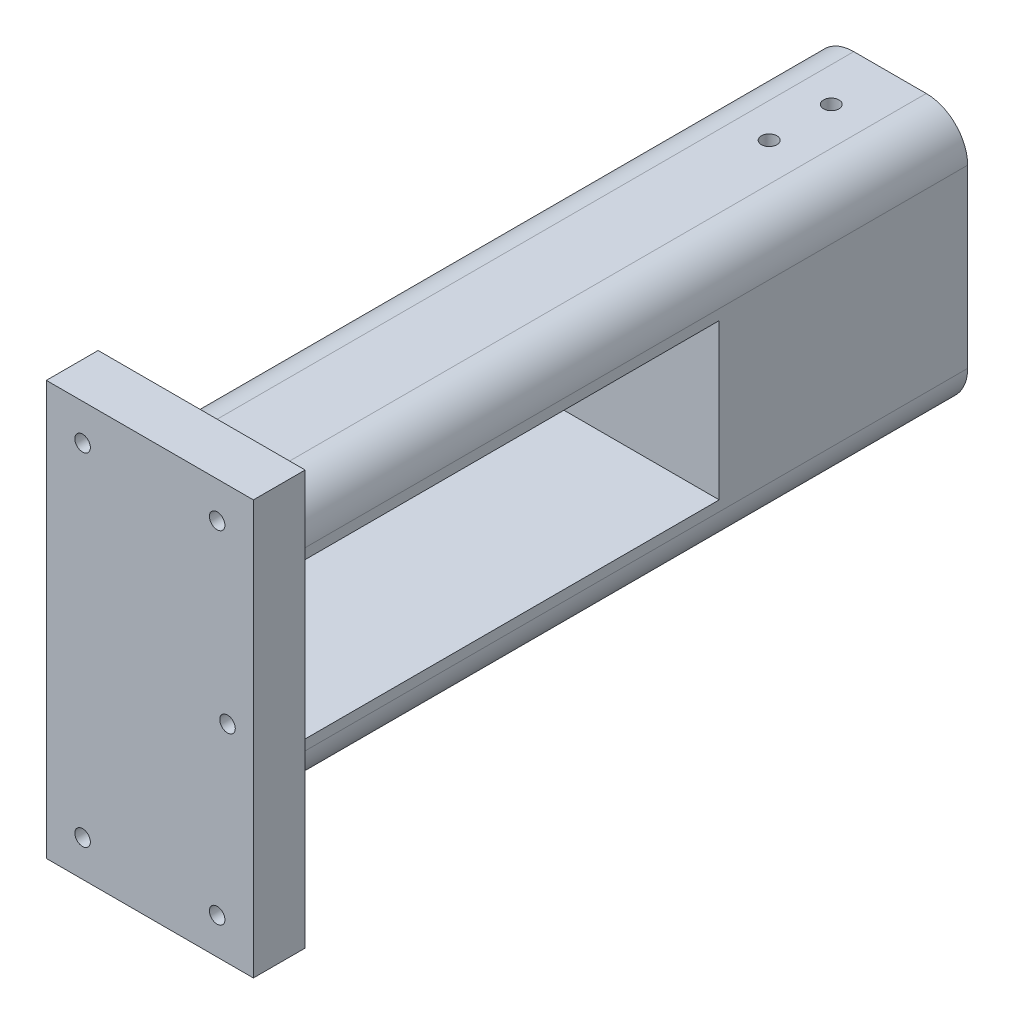
ISO-10303-21;
HEADER;
FILE_DESCRIPTION(('STEP AP214'),'2;1');
FILE_NAME('part.step','',(''),(''),'','','');
FILE_SCHEMA(('AUTOMOTIVE_DESIGN { 1 0 10303 214 1 1 1 1 }'));
ENDSEC;
DATA;
#1=APPLICATION_CONTEXT('core data for automotive mechanical design processes');
#2=APPLICATION_PROTOCOL_DEFINITION('international standard','automotive_design',2000,#1);
#3=PRODUCT_CONTEXT('',#1,'mechanical');
#4=PRODUCT('Part','Part','',(#3));
#5=PRODUCT_RELATED_PRODUCT_CATEGORY('part','',(#4));
#6=PRODUCT_DEFINITION_FORMATION('','',#4);
#7=PRODUCT_DEFINITION_CONTEXT('part definition',#1,'design');
#8=PRODUCT_DEFINITION('design','',#6,#7);
#9=PRODUCT_DEFINITION_SHAPE('','',#8);
#10=(LENGTH_UNIT() NAMED_UNIT(*) SI_UNIT(.MILLI.,.METRE.));
#11=(NAMED_UNIT(*) PLANE_ANGLE_UNIT() SI_UNIT($,.RADIAN.));
#12=(NAMED_UNIT(*) SI_UNIT($,.STERADIAN.) SOLID_ANGLE_UNIT());
#13=UNCERTAINTY_MEASURE_WITH_UNIT(LENGTH_MEASURE(1.E-05),#10,'distance_accuracy_value','');
#14=(GEOMETRIC_REPRESENTATION_CONTEXT(3) GLOBAL_UNCERTAINTY_ASSIGNED_CONTEXT((#13)) GLOBAL_UNIT_ASSIGNED_CONTEXT((#10,
#11,#12)) REPRESENTATION_CONTEXT('',''));
#15=CARTESIAN_POINT('',(0.,0.,0.));
#16=DIRECTION('',(0.,0.,1.));
#17=DIRECTION('',(1.,0.,0.));
#18=AXIS2_PLACEMENT_3D('',#15,#16,#17);
#19=CARTESIAN_POINT('',(-19.9988196070783,22.4242037473265,10.));
#20=DIRECTION('',(0.,0.,-1.));
#21=DIRECTION('',(-1.,0.,0.));
#22=AXIS2_PLACEMENT_3D('',#19,#20,#21);
#23=CYLINDRICAL_SURFACE('',#22,8.);
#24=DIRECTION('',(0.,0.,-1.));
#25=VECTOR('',#24,1.);
#26=CARTESIAN_POINT('',(-27.9988196070783,22.4242037473265,10.));
#27=LINE('',#26,#25);
#28=CARTESIAN_POINT('',(-27.9988196070783,22.4242037473265,0.));
#29=VERTEX_POINT('',#28);
#30=CARTESIAN_POINT('',(-27.9988196070783,22.4242037473265,-138.));
#31=VERTEX_POINT('',#30);
#32=EDGE_CURVE('E285',#29,#31,#27,.T.);
#33=ORIENTED_EDGE('',*,*,#32,.F.);
#34=CARTESIAN_POINT('',(-19.9988196070783,22.4242037473265,0.));
#35=DIRECTION('',(0.,0.,-1.));
#36=DIRECTION('',(-1.,0.,0.));
#37=AXIS2_PLACEMENT_3D('',#34,#35,#36);
#38=CIRCLE('',#37,8.);
#39=CARTESIAN_POINT('',(-19.9988196070783,30.4242037473265,0.));
#40=VERTEX_POINT('',#39);
#41=EDGE_CURVE('E11',#29,#40,#38,.T.);
#42=ORIENTED_EDGE('',*,*,#41,.T.);
#43=DIRECTION('',(0.,0.,-1.));
#44=VECTOR('',#43,1.);
#45=CARTESIAN_POINT('',(-19.9988196070783,30.4242037473265,-100.));
#46=LINE('',#45,#44);
#47=CARTESIAN_POINT('',(-19.9988196070783,30.4242037473265,-138.));
#48=VERTEX_POINT('',#47);
#49=EDGE_CURVE('E288',#48,#40,#46,.F.);
#50=ORIENTED_EDGE('',*,*,#49,.F.);
#51=CARTESIAN_POINT('',(-19.9988196070783,22.4242037473265,-138.));
#52=DIRECTION('',(0.,0.,1.));
#53=DIRECTION('',(1.,0.,0.));
#54=AXIS2_PLACEMENT_3D('',#51,#52,#53);
#55=CIRCLE('',#54,8.);
#56=EDGE_CURVE('E42',#31,#48,#55,.F.);
#57=ORIENTED_EDGE('',*,*,#56,.F.);
#58=EDGE_LOOP('',(#33,#42,#50,#57));
#59=FACE_BOUND('',#58,.T.);
#60=ADVANCED_FACE('F34',(#59),#23,.T.);
#61=CARTESIAN_POINT('',(-19.9988196070783,-11.5757962526735,10.));
#62=DIRECTION('',(0.,0.,1.));
#63=DIRECTION('',(1.,0.,0.));
#64=AXIS2_PLACEMENT_3D('',#61,#62,#63);
#65=CYLINDRICAL_SURFACE('',#64,8.);
#66=DIRECTION('',(0.,0.,1.));
#67=VECTOR('',#66,1.);
#68=CARTESIAN_POINT('',(-27.9988196070783,-11.5757962526735,10.));
#69=LINE('',#68,#67);
#70=CARTESIAN_POINT('',(-27.9988196070783,-11.5757962526735,-138.));
#71=VERTEX_POINT('',#70);
#72=CARTESIAN_POINT('',(-27.9988196070783,-11.5757962526735,0.));
#73=VERTEX_POINT('',#72);
#74=EDGE_CURVE('E274',#71,#73,#69,.T.);
#75=ORIENTED_EDGE('',*,*,#74,.F.);
#76=CARTESIAN_POINT('',(-19.9988196070783,-11.5757962526735,-138.));
#77=DIRECTION('',(0.,0.,1.));
#78=DIRECTION('',(1.,0.,0.));
#79=AXIS2_PLACEMENT_3D('',#76,#77,#78);
#80=CIRCLE('',#79,8.);
#81=CARTESIAN_POINT('',(-19.9988196070783,-19.5757962526735,-138.));
#82=VERTEX_POINT('',#81);
#83=EDGE_CURVE('E280',#82,#71,#80,.F.);
#84=ORIENTED_EDGE('',*,*,#83,.F.);
#85=DIRECTION('',(0.,0.,1.));
#86=VECTOR('',#85,1.);
#87=CARTESIAN_POINT('',(-19.9988196070783,-19.5757962526735,-100.));
#88=LINE('',#87,#86);
#89=CARTESIAN_POINT('',(-19.9988196070783,-19.5757962526735,0.));
#90=VERTEX_POINT('',#89);
#91=EDGE_CURVE('E277',#90,#82,#88,.F.);
#92=ORIENTED_EDGE('',*,*,#91,.F.);
#93=CARTESIAN_POINT('',(-19.9988196070783,-11.5757962526735,0.));
#94=DIRECTION('',(0.,0.,-1.));
#95=DIRECTION('',(-1.,0.,0.));
#96=AXIS2_PLACEMENT_3D('',#93,#94,#95);
#97=CIRCLE('',#96,8.);
#98=EDGE_CURVE('E282',#90,#73,#97,.T.);
#99=ORIENTED_EDGE('',*,*,#98,.T.);
#100=EDGE_LOOP('',(#75,#84,#92,#99));
#101=FACE_BOUND('',#100,.T.);
#102=ADVANCED_FACE('F339',(#101),#65,.T.);
#103=CARTESIAN_POINT('',(-5.9988196070783,22.4242037473265,-100.));
#104=DIRECTION('',(0.,0.,-1.));
#105=DIRECTION('',(-1.,0.,0.));
#106=AXIS2_PLACEMENT_3D('',#103,#104,#105);
#107=CYLINDRICAL_SURFACE('',#106,8.);
#108=DIRECTION('',(0.,0.,-1.));
#109=VECTOR('',#108,1.);
#110=CARTESIAN_POINT('',(-5.9988196070783,30.4242037473265,-100.));
#111=LINE('',#110,#109);
#112=CARTESIAN_POINT('',(-5.9988196070783,30.4242037473265,0.));
#113=VERTEX_POINT('',#112);
#114=CARTESIAN_POINT('',(-5.9988196070783,30.4242037473265,-138.));
#115=VERTEX_POINT('',#114);
#116=EDGE_CURVE('E264',#113,#115,#111,.T.);
#117=ORIENTED_EDGE('',*,*,#116,.F.);
#118=CARTESIAN_POINT('',(-5.9988196070783,22.4242037473265,0.));
#119=DIRECTION('',(0.,0.,-1.));
#120=DIRECTION('',(-1.,0.,0.));
#121=AXIS2_PLACEMENT_3D('',#118,#119,#120);
#122=CIRCLE('',#121,8.);
#123=CARTESIAN_POINT('',(2.0011803929217,22.4242037473265,0.));
#124=VERTEX_POINT('',#123);
#125=EDGE_CURVE('E272',#113,#124,#122,.T.);
#126=ORIENTED_EDGE('',*,*,#125,.T.);
#127=DIRECTION('',(0.,0.,-1.));
#128=VECTOR('',#127,1.);
#129=CARTESIAN_POINT('',(2.0011803929217,22.4242037473265,-100.));
#130=LINE('',#129,#128);
#131=CARTESIAN_POINT('',(2.0011803929217,22.4242037473265,-138.));
#132=VERTEX_POINT('',#131);
#133=EDGE_CURVE('E267',#132,#124,#130,.F.);
#134=ORIENTED_EDGE('',*,*,#133,.F.);
#135=CARTESIAN_POINT('',(-5.9988196070783,22.4242037473265,-138.));
#136=DIRECTION('',(0.,0.,1.));
#137=DIRECTION('',(1.,0.,0.));
#138=AXIS2_PLACEMENT_3D('',#135,#136,#137);
#139=CIRCLE('',#138,8.);
#140=EDGE_CURVE('E270',#115,#132,#139,.F.);
#141=ORIENTED_EDGE('',*,*,#140,.F.);
#142=EDGE_LOOP('',(#117,#126,#134,#141));
#143=FACE_BOUND('',#142,.T.);
#144=ADVANCED_FACE('F328',(#143),#107,.T.);
#145=CARTESIAN_POINT('',(-5.9988196070783,-11.5757962526735,-100.));
#146=DIRECTION('',(0.,0.,-1.));
#147=DIRECTION('',(-1.,0.,0.));
#148=AXIS2_PLACEMENT_3D('',#145,#146,#147);
#149=CYLINDRICAL_SURFACE('',#148,8.);
#150=DIRECTION('',(0.,0.,-1.));
#151=VECTOR('',#150,1.);
#152=CARTESIAN_POINT('',(2.0011803929217,-11.5757962526735,-100.));
#153=LINE('',#152,#151);
#154=CARTESIAN_POINT('',(2.0011803929217,-11.5757962526735,0.));
#155=VERTEX_POINT('',#154);
#156=CARTESIAN_POINT('',(2.0011803929217,-11.5757962526735,-138.));
#157=VERTEX_POINT('',#156);
#158=EDGE_CURVE('E255',#155,#157,#153,.T.);
#159=ORIENTED_EDGE('',*,*,#158,.F.);
#160=CARTESIAN_POINT('',(-5.9988196070783,-11.5757962526735,0.));
#161=DIRECTION('',(0.,0.,-1.));
#162=DIRECTION('',(-1.,0.,0.));
#163=AXIS2_PLACEMENT_3D('',#160,#161,#162);
#164=CIRCLE('',#163,8.);
#165=CARTESIAN_POINT('',(-5.9988196070783,-19.5757962526735,0.));
#166=VERTEX_POINT('',#165);
#167=EDGE_CURVE('E262',#155,#166,#164,.T.);
#168=ORIENTED_EDGE('',*,*,#167,.T.);
#169=DIRECTION('',(0.,0.,-1.));
#170=VECTOR('',#169,1.);
#171=CARTESIAN_POINT('',(-5.9988196070783,-19.5757962526735,-100.));
#172=LINE('',#171,#170);
#173=CARTESIAN_POINT('',(-5.9988196070783,-19.5757962526735,-138.));
#174=VERTEX_POINT('',#173);
#175=EDGE_CURVE('E257',#174,#166,#172,.F.);
#176=ORIENTED_EDGE('',*,*,#175,.F.);
#177=CARTESIAN_POINT('',(-5.9988196070783,-11.5757962526735,-138.));
#178=DIRECTION('',(0.,0.,1.));
#179=DIRECTION('',(1.,0.,0.));
#180=AXIS2_PLACEMENT_3D('',#177,#178,#179);
#181=CIRCLE('',#180,8.);
#182=EDGE_CURVE('E260',#157,#174,#181,.F.);
#183=ORIENTED_EDGE('',*,*,#182,.F.);
#184=EDGE_LOOP('',(#159,#168,#176,#183));
#185=FACE_BOUND('',#184,.T.);
#186=ADVANCED_FACE('F320',(#185),#149,.T.);
#187=CARTESIAN_POINT('',(12.0011803929217,45.4242037473265,10.));
#188=DIRECTION('',(-1.,0.,0.));
#189=DIRECTION('',(0.,-1.,0.));
#190=AXIS2_PLACEMENT_3D('',#187,#188,#189);
#191=PLANE('',#190);
#192=DIRECTION('',(0.,1.,0.));
#193=VECTOR('',#192,1.);
#194=CARTESIAN_POINT('',(12.0011803929217,45.4242037473265,0.));
#195=LINE('',#194,#193);
#196=CARTESIAN_POINT('',(12.0011803929217,-34.5757962526735,0.));
#197=VERTEX_POINT('',#196);
#198=CARTESIAN_POINT('',(12.0011803929217,45.4242037473265,0.));
#199=VERTEX_POINT('',#198);
#200=EDGE_CURVE('E291',#197,#199,#195,.T.);
#201=ORIENTED_EDGE('',*,*,#200,.T.);
#202=DIRECTION('',(0.,0.,-1.));
#203=VECTOR('',#202,1.);
#204=CARTESIAN_POINT('',(12.0011803929217,45.4242037473265,10.));
#205=LINE('',#204,#203);
#206=CARTESIAN_POINT('',(12.0011803929217,45.4242037473265,10.));
#207=VERTEX_POINT('',#206);
#208=EDGE_CURVE('E303',#207,#199,#205,.T.);
#209=ORIENTED_EDGE('',*,*,#208,.F.);
#210=DIRECTION('',(0.,1.,0.));
#211=VECTOR('',#210,1.);
#212=CARTESIAN_POINT('',(12.0011803929217,45.4242037473265,10.));
#213=LINE('',#212,#211);
#214=CARTESIAN_POINT('',(12.0011803929217,-34.5757962526735,10.));
#215=VERTEX_POINT('',#214);
#216=EDGE_CURVE('E248',#215,#207,#213,.T.);
#217=ORIENTED_EDGE('',*,*,#216,.F.);
#218=DIRECTION('',(0.,0.,-1.));
#219=VECTOR('',#218,1.);
#220=CARTESIAN_POINT('',(12.0011803929217,-34.5757962526735,10.));
#221=LINE('',#220,#219);
#222=EDGE_CURVE('E622',#215,#197,#221,.T.);
#223=ORIENTED_EDGE('',*,*,#222,.T.);
#224=EDGE_LOOP('',(#201,#209,#217,#223));
#225=FACE_BOUND('',#224,.T.);
#226=ADVANCED_FACE('F397',(#225),#191,.F.);
#227=CARTESIAN_POINT('',(12.0011803929217,45.4242037473265,10.));
#228=DIRECTION('',(0.,-1.,0.));
#229=DIRECTION('',(1.,0.,0.));
#230=AXIS2_PLACEMENT_3D('',#227,#228,#229);
#231=PLANE('',#230);
#232=DIRECTION('',(-1.,0.,0.));
#233=VECTOR('',#232,1.);
#234=CARTESIAN_POINT('',(12.0011803929217,45.4242037473265,0.));
#235=LINE('',#234,#233);
#236=CARTESIAN_POINT('',(-27.9988196070783,45.4242037473265,0.));
#237=VERTEX_POINT('',#236);
#238=EDGE_CURVE('E618',#199,#237,#235,.T.);
#239=ORIENTED_EDGE('',*,*,#238,.T.);
#240=DIRECTION('',(0.,0.,-1.));
#241=VECTOR('',#240,1.);
#242=CARTESIAN_POINT('',(-27.9988196070783,45.4242037473265,10.));
#243=LINE('',#242,#241);
#244=CARTESIAN_POINT('',(-27.9988196070783,45.4242037473265,10.));
#245=VERTEX_POINT('',#244);
#246=EDGE_CURVE('E610',#245,#237,#243,.T.);
#247=ORIENTED_EDGE('',*,*,#246,.F.);
#248=DIRECTION('',(-1.,0.,0.));
#249=VECTOR('',#248,1.);
#250=CARTESIAN_POINT('',(12.0011803929217,45.4242037473265,10.));
#251=LINE('',#250,#249);
#252=EDGE_CURVE('E600',#207,#245,#251,.T.);
#253=ORIENTED_EDGE('',*,*,#252,.F.);
#254=ORIENTED_EDGE('',*,*,#208,.T.);
#255=EDGE_LOOP('',(#239,#247,#253,#254));
#256=FACE_BOUND('',#255,.T.);
#257=ADVANCED_FACE('F400',(#256),#231,.F.);
#258=CARTESIAN_POINT('',(-27.9988196070783,45.4242037473265,10.));
#259=DIRECTION('',(1.,0.,0.));
#260=DIRECTION('',(0.,1.,0.));
#261=AXIS2_PLACEMENT_3D('',#258,#259,#260);
#262=PLANE('',#261);
#263=DIRECTION('',(0.,0.,1.));
#264=VECTOR('',#263,1.);
#265=CARTESIAN_POINT('',(-27.9988196070783,-9.57579625267348,-90.));
#266=LINE('',#265,#264);
#267=CARTESIAN_POINT('',(-27.9988196070783,-9.57579625267348,-90.));
#268=VERTEX_POINT('',#267);
#269=CARTESIAN_POINT('',(-27.9988196070783,-9.57579625267348,-9.99999999999999));
#270=VERTEX_POINT('',#269);
#271=EDGE_CURVE('E225',#268,#270,#266,.T.);
#272=ORIENTED_EDGE('',*,*,#271,.F.);
#273=DIRECTION('',(0.,-1.,0.));
#274=VECTOR('',#273,1.);
#275=CARTESIAN_POINT('',(-27.9988196070783,-9.57579625267348,-90.));
#276=LINE('',#275,#274);
#277=CARTESIAN_POINT('',(-27.9988196070783,20.4242037473265,-90.));
#278=VERTEX_POINT('',#277);
#279=EDGE_CURVE('E223',#278,#268,#276,.T.);
#280=ORIENTED_EDGE('',*,*,#279,.F.);
#281=DIRECTION('',(0.,0.,-1.));
#282=VECTOR('',#281,1.);
#283=CARTESIAN_POINT('',(-27.9988196070783,20.4242037473265,-90.));
#284=LINE('',#283,#282);
#285=CARTESIAN_POINT('',(-27.9988196070783,20.4242037473265,-9.99999999999999));
#286=VERTEX_POINT('',#285);
#287=EDGE_CURVE('E231',#286,#278,#284,.T.);
#288=ORIENTED_EDGE('',*,*,#287,.F.);
#289=DIRECTION('',(0.,1.,0.));
#290=VECTOR('',#289,1.);
#291=CARTESIAN_POINT('',(-27.9988196070783,-9.57579625267348,-9.99999999999999));
#292=LINE('',#291,#290);
#293=EDGE_CURVE('E228',#270,#286,#292,.T.);
#294=ORIENTED_EDGE('',*,*,#293,.F.);
#295=EDGE_LOOP('',(#272,#280,#288,#294));
#296=FACE_BOUND('',#295,.T.);
#297=DIRECTION('',(0.,-1.,0.));
#298=VECTOR('',#297,1.);
#299=CARTESIAN_POINT('',(-27.9988196070783,45.4242037473265,0.));
#300=LINE('',#299,#298);
#301=EDGE_CURVE('E345',#237,#29,#300,.T.);
#302=ORIENTED_EDGE('',*,*,#301,.T.);
#303=ORIENTED_EDGE('',*,*,#32,.T.);
#304=DIRECTION('',(0.,1.,0.));
#305=VECTOR('',#304,1.);
#306=CARTESIAN_POINT('',(-27.9988196070783,-19.5757962526735,-138.));
#307=LINE('',#306,#305);
#308=EDGE_CURVE('E219',#71,#31,#307,.T.);
#309=ORIENTED_EDGE('',*,*,#308,.F.);
#310=ORIENTED_EDGE('',*,*,#74,.T.);
#311=CARTESIAN_POINT('',(-27.9988196070783,-34.5757962526735,0.));
#312=VERTEX_POINT('',#311);
#313=EDGE_CURVE('E296',#73,#312,#300,.T.);
#314=ORIENTED_EDGE('',*,*,#313,.T.);
#315=DIRECTION('',(0.,0.,-1.));
#316=VECTOR('',#315,1.);
#317=CARTESIAN_POINT('',(-27.9988196070783,-34.5757962526735,10.));
#318=LINE('',#317,#316);
#319=CARTESIAN_POINT('',(-27.9988196070783,-34.5757962526735,10.));
#320=VERTEX_POINT('',#319);
#321=EDGE_CURVE('E612',#320,#312,#318,.T.);
#322=ORIENTED_EDGE('',*,*,#321,.F.);
#323=DIRECTION('',(0.,-1.,0.));
#324=VECTOR('',#323,1.);
#325=CARTESIAN_POINT('',(-27.9988196070783,45.4242037473265,10.));
#326=LINE('',#325,#324);
#327=EDGE_CURVE('E629',#245,#320,#326,.T.);
#328=ORIENTED_EDGE('',*,*,#327,.F.);
#329=ORIENTED_EDGE('',*,*,#246,.T.);
#330=EDGE_LOOP('',(#302,#303,#309,#310,#314,#322,#328,#329));
#331=FACE_BOUND('',#330,.T.);
#332=ADVANCED_FACE('F342',(#296,#331),#262,.F.);
#333=CARTESIAN_POINT('',(12.0011803929217,-34.5757962526735,10.));
#334=DIRECTION('',(0.,1.,0.));
#335=DIRECTION('',(0.,0.,1.));
#336=AXIS2_PLACEMENT_3D('',#333,#334,#335);
#337=PLANE('',#336);
#338=DIRECTION('',(1.,0.,0.));
#339=VECTOR('',#338,1.);
#340=CARTESIAN_POINT('',(12.0011803929217,-34.5757962526735,0.));
#341=LINE('',#340,#339);
#342=EDGE_CURVE('E606',#312,#197,#341,.T.);
#343=ORIENTED_EDGE('',*,*,#342,.T.);
#344=ORIENTED_EDGE('',*,*,#222,.F.);
#345=DIRECTION('',(1.,0.,0.));
#346=VECTOR('',#345,1.);
#347=CARTESIAN_POINT('',(12.0011803929217,-34.5757962526735,10.));
#348=LINE('',#347,#346);
#349=EDGE_CURVE('E603',#320,#215,#348,.T.);
#350=ORIENTED_EDGE('',*,*,#349,.F.);
#351=ORIENTED_EDGE('',*,*,#321,.T.);
#352=EDGE_LOOP('',(#343,#344,#350,#351));
#353=FACE_BOUND('',#352,.T.);
#354=ADVANCED_FACE('F407',(#353),#337,.F.);
#355=CARTESIAN_POINT('',(0.,0.,10.));
#356=DIRECTION('',(0.,0.,-1.));
#357=DIRECTION('',(-1.,0.,0.));
#358=AXIS2_PLACEMENT_3D('',#355,#356,#357);
#359=PLANE('',#358);
#360=CARTESIAN_POINT('',(7.00118039292172,5.42420374732652,10.));
#361=DIRECTION('',(0.,0.,-1.));
#362=DIRECTION('',(-1.,0.,0.));
#363=AXIS2_PLACEMENT_3D('',#360,#361,#362);
#364=CIRCLE('',#363,1.5);
#365=CARTESIAN_POINT('',(5.50118039292172,5.42420374732652,10.));
#366=VERTEX_POINT('',#365);
#367=EDGE_CURVE('E492',#366,#366,#364,.T.);
#368=ORIENTED_EDGE('',*,*,#367,.T.);
#369=EDGE_LOOP('',(#368));
#370=FACE_BOUND('',#369,.T.);
#371=CARTESIAN_POINT('',(5.00118039292172,-27.5757962526735,10.));
#372=DIRECTION('',(0.,0.,-1.));
#373=DIRECTION('',(-1.,0.,0.));
#374=AXIS2_PLACEMENT_3D('',#371,#372,#373);
#375=CIRCLE('',#374,1.5);
#376=CARTESIAN_POINT('',(3.50118039292171,-27.5757962526735,10.));
#377=VERTEX_POINT('',#376);
#378=EDGE_CURVE('E486',#377,#377,#375,.T.);
#379=ORIENTED_EDGE('',*,*,#378,.T.);
#380=EDGE_LOOP('',(#379));
#381=FACE_BOUND('',#380,.T.);
#382=CARTESIAN_POINT('',(-20.9988196070783,-27.5757962526735,10.));
#383=DIRECTION('',(0.,0.,-1.));
#384=DIRECTION('',(-1.,0.,0.));
#385=AXIS2_PLACEMENT_3D('',#382,#383,#384);
#386=CIRCLE('',#385,1.5);
#387=CARTESIAN_POINT('',(-22.4988196070783,-27.5757962526735,10.));
#388=VERTEX_POINT('',#387);
#389=EDGE_CURVE('E480',#388,#388,#386,.T.);
#390=ORIENTED_EDGE('',*,*,#389,.T.);
#391=EDGE_LOOP('',(#390));
#392=FACE_BOUND('',#391,.T.);
#393=CARTESIAN_POINT('',(5.00118039292172,38.4242037473265,10.));
#394=DIRECTION('',(0.,0.,-1.));
#395=DIRECTION('',(-1.,0.,0.));
#396=AXIS2_PLACEMENT_3D('',#393,#394,#395);
#397=CIRCLE('',#396,1.5);
#398=CARTESIAN_POINT('',(3.50118039292171,38.4242037473265,10.));
#399=VERTEX_POINT('',#398);
#400=EDGE_CURVE('E472',#399,#399,#397,.T.);
#401=ORIENTED_EDGE('',*,*,#400,.T.);
#402=EDGE_LOOP('',(#401));
#403=FACE_BOUND('',#402,.T.);
#404=CARTESIAN_POINT('',(-20.9988196070783,38.4242037473265,10.));
#405=DIRECTION('',(0.,0.,-1.));
#406=DIRECTION('',(-1.,0.,0.));
#407=AXIS2_PLACEMENT_3D('',#404,#405,#406);
#408=CIRCLE('',#407,1.5);
#409=CARTESIAN_POINT('',(-22.4988196070783,38.4242037473265,10.));
#410=VERTEX_POINT('',#409);
#411=EDGE_CURVE('E464',#410,#410,#408,.T.);
#412=ORIENTED_EDGE('',*,*,#411,.T.);
#413=EDGE_LOOP('',(#412));
#414=FACE_BOUND('',#413,.T.);
#415=ORIENTED_EDGE('',*,*,#216,.T.);
#416=ORIENTED_EDGE('',*,*,#252,.T.);
#417=ORIENTED_EDGE('',*,*,#327,.T.);
#418=ORIENTED_EDGE('',*,*,#349,.T.);
#419=EDGE_LOOP('',(#415,#416,#417,#418));
#420=FACE_BOUND('',#419,.T.);
#421=ADVANCED_FACE('F411',(#370,#381,#392,#403,#414,#420),#359,.F.);
#422=CARTESIAN_POINT('',(0.,0.,0.));
#423=DIRECTION('',(0.,0.,-1.));
#424=DIRECTION('',(-1.,0.,0.));
#425=AXIS2_PLACEMENT_3D('',#422,#423,#424);
#426=PLANE('',#425);
#427=CARTESIAN_POINT('',(7.00118039292172,5.42420374732652,0.));
#428=DIRECTION('',(0.,0.,-1.));
#429=DIRECTION('',(-1.,0.,0.));
#430=AXIS2_PLACEMENT_3D('',#427,#428,#429);
#431=CIRCLE('',#430,1.5);
#432=CARTESIAN_POINT('',(5.50118039292172,5.42420374732652,0.));
#433=VERTEX_POINT('',#432);
#434=EDGE_CURVE('E495',#433,#433,#431,.T.);
#435=ORIENTED_EDGE('',*,*,#434,.F.);
#436=EDGE_LOOP('',(#435));
#437=FACE_BOUND('',#436,.T.);
#438=CARTESIAN_POINT('',(5.00118039292172,-27.5757962526735,0.));
#439=DIRECTION('',(0.,0.,-1.));
#440=DIRECTION('',(-1.,0.,0.));
#441=AXIS2_PLACEMENT_3D('',#438,#439,#440);
#442=CIRCLE('',#441,1.5);
#443=CARTESIAN_POINT('',(3.50118039292171,-27.5757962526735,0.));
#444=VERTEX_POINT('',#443);
#445=EDGE_CURVE('E489',#444,#444,#442,.T.);
#446=ORIENTED_EDGE('',*,*,#445,.F.);
#447=EDGE_LOOP('',(#446));
#448=FACE_BOUND('',#447,.T.);
#449=CARTESIAN_POINT('',(-20.9988196070783,-27.5757962526735,0.));
#450=DIRECTION('',(0.,0.,-1.));
#451=DIRECTION('',(-1.,0.,0.));
#452=AXIS2_PLACEMENT_3D('',#449,#450,#451);
#453=CIRCLE('',#452,1.5);
#454=CARTESIAN_POINT('',(-22.4988196070783,-27.5757962526735,0.));
#455=VERTEX_POINT('',#454);
#456=EDGE_CURVE('E483',#455,#455,#453,.T.);
#457=ORIENTED_EDGE('',*,*,#456,.F.);
#458=EDGE_LOOP('',(#457));
#459=FACE_BOUND('',#458,.T.);
#460=CARTESIAN_POINT('',(5.00118039292172,38.4242037473265,0.));
#461=DIRECTION('',(0.,0.,-1.));
#462=DIRECTION('',(-1.,0.,0.));
#463=AXIS2_PLACEMENT_3D('',#460,#461,#462);
#464=CIRCLE('',#463,1.5);
#465=CARTESIAN_POINT('',(3.50118039292171,38.4242037473265,0.));
#466=VERTEX_POINT('',#465);
#467=EDGE_CURVE('E477',#466,#466,#464,.T.);
#468=ORIENTED_EDGE('',*,*,#467,.F.);
#469=EDGE_LOOP('',(#468));
#470=FACE_BOUND('',#469,.T.);
#471=CARTESIAN_POINT('',(-20.9988196070783,38.4242037473265,0.));
#472=DIRECTION('',(0.,0.,-1.));
#473=DIRECTION('',(-1.,0.,0.));
#474=AXIS2_PLACEMENT_3D('',#471,#472,#473);
#475=CIRCLE('',#474,1.5);
#476=CARTESIAN_POINT('',(-22.4988196070783,38.4242037473265,0.));
#477=VERTEX_POINT('',#476);
#478=EDGE_CURVE('E467',#477,#477,#475,.T.);
#479=ORIENTED_EDGE('',*,*,#478,.F.);
#480=EDGE_LOOP('',(#479));
#481=FACE_BOUND('',#480,.T.);
#482=DIRECTION('',(1.,0.,0.));
#483=VECTOR('',#482,1.);
#484=CARTESIAN_POINT('',(2.0011803929217,30.4242037473265,0.));
#485=LINE('',#484,#483);
#486=EDGE_CURVE('E254',#40,#113,#485,.T.);
#487=ORIENTED_EDGE('',*,*,#486,.F.);
#488=ORIENTED_EDGE('',*,*,#41,.F.);
#489=ORIENTED_EDGE('',*,*,#301,.F.);
#490=ORIENTED_EDGE('',*,*,#238,.F.);
#491=ORIENTED_EDGE('',*,*,#200,.F.);
#492=ORIENTED_EDGE('',*,*,#342,.F.);
#493=ORIENTED_EDGE('',*,*,#313,.F.);
#494=ORIENTED_EDGE('',*,*,#98,.F.);
#495=DIRECTION('',(-1.,0.,0.));
#496=VECTOR('',#495,1.);
#497=CARTESIAN_POINT('',(2.0011803929217,-19.5757962526735,0.));
#498=LINE('',#497,#496);
#499=EDGE_CURVE('E245',#166,#90,#498,.T.);
#500=ORIENTED_EDGE('',*,*,#499,.F.);
#501=ORIENTED_EDGE('',*,*,#167,.F.);
#502=DIRECTION('',(0.,-1.,0.));
#503=VECTOR('',#502,1.);
#504=CARTESIAN_POINT('',(2.0011803929217,-19.5757962526735,0.));
#505=LINE('',#504,#503);
#506=EDGE_CURVE('E237',#124,#155,#505,.T.);
#507=ORIENTED_EDGE('',*,*,#506,.F.);
#508=ORIENTED_EDGE('',*,*,#125,.F.);
#509=EDGE_LOOP('',(#487,#488,#489,#490,#491,#492,#493,#494,#500,#501,#507,#508));
#510=FACE_BOUND('',#509,.T.);
#511=ADVANCED_FACE('F332',(#437,#448,#459,#470,#481,#510),#426,.T.);
#512=CARTESIAN_POINT('',(2.0011803929217,-19.5757962526735,-100.));
#513=DIRECTION('',(-1.,0.,0.));
#514=DIRECTION('',(0.,0.,1.));
#515=AXIS2_PLACEMENT_3D('',#512,#513,#514);
#516=PLANE('',#515);
#517=DIRECTION('',(0.,0.,-1.));
#518=VECTOR('',#517,1.);
#519=CARTESIAN_POINT('',(2.0011803929217,20.4242037473265,-100.));
#520=LINE('',#519,#518);
#521=CARTESIAN_POINT('',(2.0011803929217,20.4242037473265,-9.99999999999999));
#522=VERTEX_POINT('',#521);
#523=CARTESIAN_POINT('',(2.0011803929217,20.4242037473265,-90.));
#524=VERTEX_POINT('',#523);
#525=EDGE_CURVE('E306',#522,#524,#520,.T.);
#526=ORIENTED_EDGE('',*,*,#525,.T.);
#527=DIRECTION('',(0.,-1.,0.));
#528=VECTOR('',#527,1.);
#529=CARTESIAN_POINT('',(2.0011803929217,-19.5757962526735,-90.));
#530=LINE('',#529,#528);
#531=CARTESIAN_POINT('',(2.0011803929217,-9.57579625267347,-90.));
#532=VERTEX_POINT('',#531);
#533=EDGE_CURVE('E308',#524,#532,#530,.T.);
#534=ORIENTED_EDGE('',*,*,#533,.T.);
#535=DIRECTION('',(0.,0.,1.));
#536=VECTOR('',#535,1.);
#537=CARTESIAN_POINT('',(2.0011803929217,-9.57579625267347,-100.));
#538=LINE('',#537,#536);
#539=CARTESIAN_POINT('',(2.0011803929217,-9.57579625267347,-9.99999999999999));
#540=VERTEX_POINT('',#539);
#541=EDGE_CURVE('E299',#532,#540,#538,.T.);
#542=ORIENTED_EDGE('',*,*,#541,.T.);
#543=DIRECTION('',(0.,1.,0.));
#544=VECTOR('',#543,1.);
#545=CARTESIAN_POINT('',(2.0011803929217,-19.5757962526735,-9.99999999999999));
#546=LINE('',#545,#544);
#547=EDGE_CURVE('E302',#540,#522,#546,.T.);
#548=ORIENTED_EDGE('',*,*,#547,.T.);
#549=EDGE_LOOP('',(#526,#534,#542,#548));
#550=FACE_BOUND('',#549,.T.);
#551=DIRECTION('',(0.,-1.,0.));
#552=VECTOR('',#551,1.);
#553=CARTESIAN_POINT('',(2.0011803929217,-19.5757962526735,-138.));
#554=LINE('',#553,#552);
#555=EDGE_CURVE('E189',#132,#157,#554,.T.);
#556=ORIENTED_EDGE('',*,*,#555,.F.);
#557=ORIENTED_EDGE('',*,*,#133,.T.);
#558=ORIENTED_EDGE('',*,*,#506,.T.);
#559=ORIENTED_EDGE('',*,*,#158,.T.);
#560=EDGE_LOOP('',(#556,#557,#558,#559));
#561=FACE_BOUND('',#560,.T.);
#562=ADVANCED_FACE('F315',(#550,#561),#516,.F.);
#563=CARTESIAN_POINT('',(2.0011803929217,-19.5757962526735,-100.));
#564=DIRECTION('',(0.,1.,0.));
#565=DIRECTION('',(0.,0.,1.));
#566=AXIS2_PLACEMENT_3D('',#563,#564,#565);
#567=PLANE('',#566);
#568=CARTESIAN_POINT('',(-13.3488196070783,-19.5757962526735,-127.));
#569=DIRECTION('',(0.,1.,0.));
#570=DIRECTION('',(0.,0.,1.));
#571=AXIS2_PLACEMENT_3D('',#568,#569,#570);
#572=CIRCLE('',#571,1.5);
#573=CARTESIAN_POINT('',(-13.3488196070783,-19.5757962526735,-125.5));
#574=VERTEX_POINT('',#573);
#575=EDGE_CURVE('E349',#574,#574,#572,.T.);
#576=ORIENTED_EDGE('',*,*,#575,.T.);
#577=EDGE_LOOP('',(#576));
#578=FACE_BOUND('',#577,.T.);
#579=CARTESIAN_POINT('',(-13.3488196070783,-19.5757962526735,-115.));
#580=DIRECTION('',(0.,1.,0.));
#581=DIRECTION('',(0.,0.,1.));
#582=AXIS2_PLACEMENT_3D('',#579,#580,#581);
#583=CIRCLE('',#582,1.5);
#584=CARTESIAN_POINT('',(-13.3488196070783,-19.5757962526735,-113.5));
#585=VERTEX_POINT('',#584);
#586=EDGE_CURVE('E204',#585,#585,#583,.T.);
#587=ORIENTED_EDGE('',*,*,#586,.T.);
#588=EDGE_LOOP('',(#587));
#589=FACE_BOUND('',#588,.T.);
#590=ORIENTED_EDGE('',*,*,#499,.T.);
#591=ORIENTED_EDGE('',*,*,#91,.T.);
#592=DIRECTION('',(-1.,0.,0.));
#593=VECTOR('',#592,1.);
#594=CARTESIAN_POINT('',(2.0011803929217,-19.5757962526735,-138.));
#595=LINE('',#594,#593);
#596=EDGE_CURVE('E216',#174,#82,#595,.T.);
#597=ORIENTED_EDGE('',*,*,#596,.F.);
#598=ORIENTED_EDGE('',*,*,#175,.T.);
#599=EDGE_LOOP('',(#590,#591,#597,#598));
#600=FACE_BOUND('',#599,.T.);
#601=ADVANCED_FACE('F336',(#578,#589,#600),#567,.F.);
#602=CARTESIAN_POINT('',(2.0011803929217,30.4242037473265,-100.));
#603=DIRECTION('',(0.,-1.,0.));
#604=DIRECTION('',(0.,0.,-1.));
#605=AXIS2_PLACEMENT_3D('',#602,#603,#604);
#606=PLANE('',#605);
#607=CARTESIAN_POINT('',(-13.3488196070783,30.4242037473265,-127.));
#608=DIRECTION('',(0.,-1.,0.));
#609=DIRECTION('',(0.,0.,-1.));
#610=AXIS2_PLACEMENT_3D('',#607,#608,#609);
#611=CIRCLE('',#610,1.5);
#612=CARTESIAN_POINT('',(-13.3488196070783,30.4242037473265,-128.5));
#613=VERTEX_POINT('',#612);
#614=EDGE_CURVE('E356',#613,#613,#611,.T.);
#615=ORIENTED_EDGE('',*,*,#614,.T.);
#616=EDGE_LOOP('',(#615));
#617=FACE_BOUND('',#616,.T.);
#618=CARTESIAN_POINT('',(-13.3488196070783,30.4242037473265,-115.));
#619=DIRECTION('',(0.,-1.,0.));
#620=DIRECTION('',(0.,0.,-1.));
#621=AXIS2_PLACEMENT_3D('',#618,#619,#620);
#622=CIRCLE('',#621,1.5);
#623=CARTESIAN_POINT('',(-13.3488196070783,30.4242037473265,-116.5));
#624=VERTEX_POINT('',#623);
#625=EDGE_CURVE('E353',#624,#624,#622,.T.);
#626=ORIENTED_EDGE('',*,*,#625,.T.);
#627=EDGE_LOOP('',(#626));
#628=FACE_BOUND('',#627,.T.);
#629=DIRECTION('',(1.,0.,0.));
#630=VECTOR('',#629,1.);
#631=CARTESIAN_POINT('',(2.0011803929217,30.4242037473265,-138.));
#632=LINE('',#631,#630);
#633=EDGE_CURVE('E221',#48,#115,#632,.T.);
#634=ORIENTED_EDGE('',*,*,#633,.F.);
#635=ORIENTED_EDGE('',*,*,#49,.T.);
#636=ORIENTED_EDGE('',*,*,#486,.T.);
#637=ORIENTED_EDGE('',*,*,#116,.T.);
#638=EDGE_LOOP('',(#634,#635,#636,#637));
#639=FACE_BOUND('',#638,.T.);
#640=ADVANCED_FACE('F423',(#617,#628,#639),#606,.F.);
#641=CARTESIAN_POINT('',(122.001180392922,-9.57579625267345,-90.));
#642=DIRECTION('',(0.,0.,-1.));
#643=DIRECTION('',(-1.,0.,0.));
#644=AXIS2_PLACEMENT_3D('',#641,#642,#643);
#645=PLANE('',#644);
#646=DIRECTION('',(-1.,0.,0.));
#647=VECTOR('',#646,1.);
#648=CARTESIAN_POINT('',(122.001180392922,20.4242037473266,-90.));
#649=LINE('',#648,#647);
#650=EDGE_CURVE('E235',#524,#278,#649,.T.);
#651=ORIENTED_EDGE('',*,*,#650,.T.);
#652=ORIENTED_EDGE('',*,*,#279,.T.);
#653=DIRECTION('',(-1.,0.,0.));
#654=VECTOR('',#653,1.);
#655=CARTESIAN_POINT('',(122.001180392922,-9.57579625267345,-90.));
#656=LINE('',#655,#654);
#657=EDGE_CURVE('E234',#532,#268,#656,.T.);
#658=ORIENTED_EDGE('',*,*,#657,.F.);
#659=ORIENTED_EDGE('',*,*,#533,.F.);
#660=EDGE_LOOP('',(#651,#652,#658,#659));
#661=FACE_BOUND('',#660,.T.);
#662=ADVANCED_FACE('F425',(#661),#645,.F.);
#663=CARTESIAN_POINT('',(122.001180392922,20.4242037473266,-90.));
#664=DIRECTION('',(0.,1.,0.));
#665=DIRECTION('',(-1.,0.,0.));
#666=AXIS2_PLACEMENT_3D('',#663,#664,#665);
#667=PLANE('',#666);
#668=DIRECTION('',(-1.,0.,0.));
#669=VECTOR('',#668,1.);
#670=CARTESIAN_POINT('',(122.001180392922,20.4242037473266,-9.99999999999999));
#671=LINE('',#670,#669);
#672=EDGE_CURVE('E238',#522,#286,#671,.T.);
#673=ORIENTED_EDGE('',*,*,#672,.T.);
#674=ORIENTED_EDGE('',*,*,#287,.T.);
#675=ORIENTED_EDGE('',*,*,#650,.F.);
#676=ORIENTED_EDGE('',*,*,#525,.F.);
#677=EDGE_LOOP('',(#673,#674,#675,#676));
#678=FACE_BOUND('',#677,.T.);
#679=ADVANCED_FACE('F430',(#678),#667,.F.);
#680=CARTESIAN_POINT('',(122.001180392922,-9.57579625267345,-9.99999999999999));
#681=DIRECTION('',(0.,0.,1.));
#682=DIRECTION('',(1.,0.,0.));
#683=AXIS2_PLACEMENT_3D('',#680,#681,#682);
#684=PLANE('',#683);
#685=DIRECTION('',(-1.,0.,0.));
#686=VECTOR('',#685,1.);
#687=CARTESIAN_POINT('',(122.001180392922,-9.57579625267345,-9.99999999999999));
#688=LINE('',#687,#686);
#689=EDGE_CURVE('E240',#540,#270,#688,.T.);
#690=ORIENTED_EDGE('',*,*,#689,.T.);
#691=ORIENTED_EDGE('',*,*,#293,.T.);
#692=ORIENTED_EDGE('',*,*,#672,.F.);
#693=ORIENTED_EDGE('',*,*,#547,.F.);
#694=EDGE_LOOP('',(#690,#691,#692,#693));
#695=FACE_BOUND('',#694,.T.);
#696=ADVANCED_FACE('F435',(#695),#684,.F.);
#697=CARTESIAN_POINT('',(122.001180392922,-9.57579625267345,-90.));
#698=DIRECTION('',(0.,-1.,0.));
#699=DIRECTION('',(1.,0.,0.));
#700=AXIS2_PLACEMENT_3D('',#697,#698,#699);
#701=PLANE('',#700);
#702=ORIENTED_EDGE('',*,*,#657,.T.);
#703=ORIENTED_EDGE('',*,*,#271,.T.);
#704=ORIENTED_EDGE('',*,*,#689,.F.);
#705=ORIENTED_EDGE('',*,*,#541,.F.);
#706=EDGE_LOOP('',(#702,#703,#704,#705));
#707=FACE_BOUND('',#706,.T.);
#708=ADVANCED_FACE('F432',(#707),#701,.F.);
#709=CARTESIAN_POINT('',(0.,0.,-138.));
#710=DIRECTION('',(0.,0.,1.));
#711=DIRECTION('',(1.,0.,0.));
#712=AXIS2_PLACEMENT_3D('',#709,#710,#711);
#713=PLANE('',#712);
#714=ORIENTED_EDGE('',*,*,#308,.T.);
#715=ORIENTED_EDGE('',*,*,#56,.T.);
#716=ORIENTED_EDGE('',*,*,#633,.T.);
#717=ORIENTED_EDGE('',*,*,#140,.T.);
#718=ORIENTED_EDGE('',*,*,#555,.T.);
#719=ORIENTED_EDGE('',*,*,#182,.T.);
#720=ORIENTED_EDGE('',*,*,#596,.T.);
#721=ORIENTED_EDGE('',*,*,#83,.T.);
#722=EDGE_LOOP('',(#714,#715,#716,#717,#718,#719,#720,#721));
#723=FACE_BOUND('',#722,.T.);
#724=DIRECTION('',(0.,1.,0.));
#725=VECTOR('',#724,1.);
#726=CARTESIAN_POINT('',(-20.9988196070783,20.4242037473265,-138.));
#727=LINE('',#726,#725);
#728=CARTESIAN_POINT('',(-20.9988196070783,-10.0757962526735,-138.));
#729=VERTEX_POINT('',#728);
#730=CARTESIAN_POINT('',(-20.9988196070783,20.4242037473265,-138.));
#731=VERTEX_POINT('',#730);
#732=EDGE_CURVE('E171',#729,#731,#727,.T.);
#733=ORIENTED_EDGE('',*,*,#732,.F.);
#734=DIRECTION('',(-1.,0.,0.));
#735=VECTOR('',#734,1.);
#736=CARTESIAN_POINT('',(-20.9988196070783,-10.0757962526735,-138.));
#737=LINE('',#736,#735);
#738=CARTESIAN_POINT('',(-5.6988196070783,-10.0757962526735,-138.));
#739=VERTEX_POINT('',#738);
#740=EDGE_CURVE('E197',#739,#729,#737,.T.);
#741=ORIENTED_EDGE('',*,*,#740,.F.);
#742=DIRECTION('',(0.,-1.,0.));
#743=VECTOR('',#742,1.);
#744=CARTESIAN_POINT('',(-5.6988196070783,20.4242037473265,-138.));
#745=LINE('',#744,#743);
#746=CARTESIAN_POINT('',(-5.6988196070783,20.4242037473265,-138.));
#747=VERTEX_POINT('',#746);
#748=EDGE_CURVE('E195',#747,#739,#745,.T.);
#749=ORIENTED_EDGE('',*,*,#748,.F.);
#750=DIRECTION('',(1.,0.,0.));
#751=VECTOR('',#750,1.);
#752=CARTESIAN_POINT('',(-20.9988196070783,20.4242037473265,-138.));
#753=LINE('',#752,#751);
#754=EDGE_CURVE('E181',#731,#747,#753,.T.);
#755=ORIENTED_EDGE('',*,*,#754,.F.);
#756=EDGE_LOOP('',(#733,#741,#749,#755));
#757=FACE_BOUND('',#756,.T.);
#758=ADVANCED_FACE('F193',(#723,#757),#713,.F.);
#759=CARTESIAN_POINT('',(-20.9988196070783,20.4242037473265,-138.));
#760=DIRECTION('',(1.,0.,0.));
#761=DIRECTION('',(0.,1.,0.));
#762=AXIS2_PLACEMENT_3D('',#759,#760,#761);
#763=PLANE('',#762);
#764=DIRECTION('',(0.,1.,0.));
#765=VECTOR('',#764,1.);
#766=CARTESIAN_POINT('',(-20.9988196070783,20.4242037473265,-100.));
#767=LINE('',#766,#765);
#768=CARTESIAN_POINT('',(-20.9988196070783,-10.0757962526735,-100.));
#769=VERTEX_POINT('',#768);
#770=CARTESIAN_POINT('',(-20.9988196070783,20.4242037473265,-100.));
#771=VERTEX_POINT('',#770);
#772=EDGE_CURVE('E202',#769,#771,#767,.T.);
#773=ORIENTED_EDGE('',*,*,#772,.F.);
#774=DIRECTION('',(0.,0.,1.));
#775=VECTOR('',#774,1.);
#776=CARTESIAN_POINT('',(-20.9988196070783,-10.0757962526735,-138.));
#777=LINE('',#776,#775);
#778=EDGE_CURVE('E177',#729,#769,#777,.T.);
#779=ORIENTED_EDGE('',*,*,#778,.F.);
#780=ORIENTED_EDGE('',*,*,#732,.T.);
#781=DIRECTION('',(0.,0.,1.));
#782=VECTOR('',#781,1.);
#783=CARTESIAN_POINT('',(-20.9988196070783,20.4242037473265,-138.));
#784=LINE('',#783,#782);
#785=EDGE_CURVE('E175',#731,#771,#784,.T.);
#786=ORIENTED_EDGE('',*,*,#785,.T.);
#787=EDGE_LOOP('',(#773,#779,#780,#786));
#788=FACE_BOUND('',#787,.T.);
#789=ADVANCED_FACE('F174',(#788),#763,.T.);
#790=CARTESIAN_POINT('',(-20.9988196070783,20.4242037473265,-138.));
#791=DIRECTION('',(0.,-1.,0.));
#792=DIRECTION('',(1.,0.,0.));
#793=AXIS2_PLACEMENT_3D('',#790,#791,#792);
#794=PLANE('',#793);
#795=CARTESIAN_POINT('',(-13.3488196070783,20.4242037473265,-127.));
#796=DIRECTION('',(0.,-1.,0.));
#797=DIRECTION('',(1.,0.,0.));
#798=AXIS2_PLACEMENT_3D('',#795,#796,#797);
#799=CIRCLE('',#798,1.5);
#800=CARTESIAN_POINT('',(-11.8488196070783,20.4242037473265,-127.));
#801=VERTEX_POINT('',#800);
#802=EDGE_CURVE('E361',#801,#801,#799,.T.);
#803=ORIENTED_EDGE('',*,*,#802,.F.);
#804=EDGE_LOOP('',(#803));
#805=FACE_BOUND('',#804,.T.);
#806=CARTESIAN_POINT('',(-13.3488196070783,20.4242037473265,-115.));
#807=DIRECTION('',(0.,-1.,0.));
#808=DIRECTION('',(1.,0.,0.));
#809=AXIS2_PLACEMENT_3D('',#806,#807,#808);
#810=CIRCLE('',#809,1.5);
#811=CARTESIAN_POINT('',(-11.8488196070783,20.4242037473265,-115.));
#812=VERTEX_POINT('',#811);
#813=EDGE_CURVE('E348',#812,#812,#810,.T.);
#814=ORIENTED_EDGE('',*,*,#813,.F.);
#815=EDGE_LOOP('',(#814));
#816=FACE_BOUND('',#815,.T.);
#817=DIRECTION('',(1.,0.,0.));
#818=VECTOR('',#817,1.);
#819=CARTESIAN_POINT('',(-20.9988196070783,20.4242037473265,-100.));
#820=LINE('',#819,#818);
#821=CARTESIAN_POINT('',(-5.6988196070783,20.4242037473265,-100.));
#822=VERTEX_POINT('',#821);
#823=EDGE_CURVE('E188',#771,#822,#820,.T.);
#824=ORIENTED_EDGE('',*,*,#823,.F.);
#825=ORIENTED_EDGE('',*,*,#785,.F.);
#826=ORIENTED_EDGE('',*,*,#754,.T.);
#827=DIRECTION('',(0.,0.,1.));
#828=VECTOR('',#827,1.);
#829=CARTESIAN_POINT('',(-5.6988196070783,20.4242037473265,-138.));
#830=LINE('',#829,#828);
#831=EDGE_CURVE('E190',#747,#822,#830,.T.);
#832=ORIENTED_EDGE('',*,*,#831,.T.);
#833=EDGE_LOOP('',(#824,#825,#826,#832));
#834=FACE_BOUND('',#833,.T.);
#835=ADVANCED_FACE('F185',(#805,#816,#834),#794,.T.);
#836=CARTESIAN_POINT('',(-5.6988196070783,20.4242037473265,-138.));
#837=DIRECTION('',(-1.,0.,0.));
#838=DIRECTION('',(0.,-1.,0.));
#839=AXIS2_PLACEMENT_3D('',#836,#837,#838);
#840=PLANE('',#839);
#841=DIRECTION('',(0.,-1.,0.));
#842=VECTOR('',#841,1.);
#843=CARTESIAN_POINT('',(-5.6988196070783,20.4242037473265,-100.));
#844=LINE('',#843,#842);
#845=CARTESIAN_POINT('',(-5.6988196070783,-10.0757962526735,-100.));
#846=VERTEX_POINT('',#845);
#847=EDGE_CURVE('E206',#822,#846,#844,.T.);
#848=ORIENTED_EDGE('',*,*,#847,.F.);
#849=ORIENTED_EDGE('',*,*,#831,.F.);
#850=ORIENTED_EDGE('',*,*,#748,.T.);
#851=DIRECTION('',(0.,0.,1.));
#852=VECTOR('',#851,1.);
#853=CARTESIAN_POINT('',(-5.6988196070783,-10.0757962526735,-138.));
#854=LINE('',#853,#852);
#855=EDGE_CURVE('E212',#739,#846,#854,.T.);
#856=ORIENTED_EDGE('',*,*,#855,.T.);
#857=EDGE_LOOP('',(#848,#849,#850,#856));
#858=FACE_BOUND('',#857,.T.);
#859=ADVANCED_FACE('F449',(#858),#840,.T.);
#860=CARTESIAN_POINT('',(-20.9988196070783,-10.0757962526735,-138.));
#861=DIRECTION('',(0.,1.,0.));
#862=DIRECTION('',(-1.,0.,0.));
#863=AXIS2_PLACEMENT_3D('',#860,#861,#862);
#864=PLANE('',#863);
#865=CARTESIAN_POINT('',(-13.3488196070783,-10.0757962526735,-127.));
#866=DIRECTION('',(0.,1.,0.));
#867=DIRECTION('',(-1.,0.,0.));
#868=AXIS2_PLACEMENT_3D('',#865,#866,#867);
#869=CIRCLE('',#868,1.5);
#870=CARTESIAN_POINT('',(-14.8488196070783,-10.0757962526735,-127.));
#871=VERTEX_POINT('',#870);
#872=EDGE_CURVE('E37',#871,#871,#869,.T.);
#873=ORIENTED_EDGE('',*,*,#872,.F.);
#874=EDGE_LOOP('',(#873));
#875=FACE_BOUND('',#874,.T.);
#876=CARTESIAN_POINT('',(-13.3488196070783,-10.0757962526735,-115.));
#877=DIRECTION('',(0.,1.,0.));
#878=DIRECTION('',(-1.,0.,0.));
#879=AXIS2_PLACEMENT_3D('',#876,#877,#878);
#880=CIRCLE('',#879,1.5);
#881=CARTESIAN_POINT('',(-14.8488196070783,-10.0757962526735,-115.));
#882=VERTEX_POINT('',#881);
#883=EDGE_CURVE('E346',#882,#882,#880,.T.);
#884=ORIENTED_EDGE('',*,*,#883,.F.);
#885=EDGE_LOOP('',(#884));
#886=FACE_BOUND('',#885,.T.);
#887=DIRECTION('',(-1.,0.,0.));
#888=VECTOR('',#887,1.);
#889=CARTESIAN_POINT('',(-20.9988196070783,-10.0757962526735,-100.));
#890=LINE('',#889,#888);
#891=EDGE_CURVE('E182',#846,#769,#890,.T.);
#892=ORIENTED_EDGE('',*,*,#891,.F.);
#893=ORIENTED_EDGE('',*,*,#855,.F.);
#894=ORIENTED_EDGE('',*,*,#740,.T.);
#895=ORIENTED_EDGE('',*,*,#778,.T.);
#896=EDGE_LOOP('',(#892,#893,#894,#895));
#897=FACE_BOUND('',#896,.T.);
#898=ADVANCED_FACE('F381',(#875,#886,#897),#864,.T.);
#899=CARTESIAN_POINT('',(0.,0.,-100.));
#900=DIRECTION('',(0.,0.,1.));
#901=DIRECTION('',(1.,0.,0.));
#902=AXIS2_PLACEMENT_3D('',#899,#900,#901);
#903=PLANE('',#902);
#904=ORIENTED_EDGE('',*,*,#891,.T.);
#905=ORIENTED_EDGE('',*,*,#772,.T.);
#906=ORIENTED_EDGE('',*,*,#823,.T.);
#907=ORIENTED_EDGE('',*,*,#847,.T.);
#908=EDGE_LOOP('',(#904,#905,#906,#907));
#909=FACE_BOUND('',#908,.T.);
#910=ADVANCED_FACE('F373',(#909),#903,.F.);
#911=CARTESIAN_POINT('',(-13.3488196070783,45.4242287473265,-115.));
#912=DIRECTION('',(0.,-1.,0.));
#913=DIRECTION('',(0.,0.,-1.));
#914=AXIS2_PLACEMENT_3D('',#911,#912,#913);
#915=CYLINDRICAL_SURFACE('',#914,1.5);
#916=ORIENTED_EDGE('',*,*,#883,.T.);
#917=EDGE_LOOP('',(#916));
#918=FACE_BOUND('',#917,.T.);
#919=ORIENTED_EDGE('',*,*,#586,.F.);
#920=EDGE_LOOP('',(#919));
#921=FACE_BOUND('',#920,.T.);
#922=ADVANCED_FACE('F370',(#918,#921),#915,.F.);
#923=ORIENTED_EDGE('',*,*,#813,.T.);
#924=EDGE_LOOP('',(#923));
#925=FACE_BOUND('',#924,.T.);
#926=ORIENTED_EDGE('',*,*,#625,.F.);
#927=EDGE_LOOP('',(#926));
#928=FACE_BOUND('',#927,.T.);
#929=ADVANCED_FACE('F372',(#925,#928),#915,.F.);
#930=CARTESIAN_POINT('',(-13.3488196070783,45.4242287473265,-127.));
#931=DIRECTION('',(0.,-1.,0.));
#932=DIRECTION('',(0.,0.,-1.));
#933=AXIS2_PLACEMENT_3D('',#930,#931,#932);
#934=CYLINDRICAL_SURFACE('',#933,1.5);
#935=ORIENTED_EDGE('',*,*,#872,.T.);
#936=EDGE_LOOP('',(#935));
#937=FACE_BOUND('',#936,.T.);
#938=ORIENTED_EDGE('',*,*,#575,.F.);
#939=EDGE_LOOP('',(#938));
#940=FACE_BOUND('',#939,.T.);
#941=ADVANCED_FACE('F379',(#937,#940),#934,.F.);
#942=ORIENTED_EDGE('',*,*,#802,.T.);
#943=EDGE_LOOP('',(#942));
#944=FACE_BOUND('',#943,.T.);
#945=ORIENTED_EDGE('',*,*,#614,.F.);
#946=EDGE_LOOP('',(#945));
#947=FACE_BOUND('',#946,.T.);
#948=ADVANCED_FACE('F514',(#944,#947),#934,.F.);
#949=CARTESIAN_POINT('',(-20.9988196070783,38.4242037473265,40.));
#950=DIRECTION('',(0.,0.,-1.));
#951=DIRECTION('',(-1.,0.,0.));
#952=AXIS2_PLACEMENT_3D('',#949,#950,#951);
#953=CYLINDRICAL_SURFACE('',#952,1.5);
#954=ORIENTED_EDGE('',*,*,#478,.T.);
#955=EDGE_LOOP('',(#954));
#956=FACE_BOUND('',#955,.T.);
#957=ORIENTED_EDGE('',*,*,#411,.F.);
#958=EDGE_LOOP('',(#957));
#959=FACE_BOUND('',#958,.T.);
#960=ADVANCED_FACE('F510',(#956,#959),#953,.F.);
#961=CARTESIAN_POINT('',(5.00118039292172,38.4242037473265,40.));
#962=DIRECTION('',(0.,0.,-1.));
#963=DIRECTION('',(-1.,0.,0.));
#964=AXIS2_PLACEMENT_3D('',#961,#962,#963);
#965=CYLINDRICAL_SURFACE('',#964,1.5);
#966=ORIENTED_EDGE('',*,*,#467,.T.);
#967=EDGE_LOOP('',(#966));
#968=FACE_BOUND('',#967,.T.);
#969=ORIENTED_EDGE('',*,*,#400,.F.);
#970=EDGE_LOOP('',(#969));
#971=FACE_BOUND('',#970,.T.);
#972=ADVANCED_FACE('F513',(#968,#971),#965,.F.);
#973=CARTESIAN_POINT('',(-20.9988196070783,-27.5757962526735,40.));
#974=DIRECTION('',(0.,0.,-1.));
#975=DIRECTION('',(-1.,0.,0.));
#976=AXIS2_PLACEMENT_3D('',#973,#974,#975);
#977=CYLINDRICAL_SURFACE('',#976,1.5);
#978=ORIENTED_EDGE('',*,*,#456,.T.);
#979=EDGE_LOOP('',(#978));
#980=FACE_BOUND('',#979,.T.);
#981=ORIENTED_EDGE('',*,*,#389,.F.);
#982=EDGE_LOOP('',(#981));
#983=FACE_BOUND('',#982,.T.);
#984=ADVANCED_FACE('F520',(#980,#983),#977,.F.);
#985=CARTESIAN_POINT('',(5.00118039292172,-27.5757962526735,40.));
#986=DIRECTION('',(0.,0.,-1.));
#987=DIRECTION('',(-1.,0.,0.));
#988=AXIS2_PLACEMENT_3D('',#985,#986,#987);
#989=CYLINDRICAL_SURFACE('',#988,1.5);
#990=ORIENTED_EDGE('',*,*,#445,.T.);
#991=EDGE_LOOP('',(#990));
#992=FACE_BOUND('',#991,.T.);
#993=ORIENTED_EDGE('',*,*,#378,.F.);
#994=EDGE_LOOP('',(#993));
#995=FACE_BOUND('',#994,.T.);
#996=ADVANCED_FACE('F568',(#992,#995),#989,.F.);
#997=CARTESIAN_POINT('',(7.00118039292172,5.42420374732652,40.));
#998=DIRECTION('',(0.,0.,-1.));
#999=DIRECTION('',(-1.,0.,0.));
#1000=AXIS2_PLACEMENT_3D('',#997,#998,#999);
#1001=CYLINDRICAL_SURFACE('',#1000,1.5);
#1002=ORIENTED_EDGE('',*,*,#434,.T.);
#1003=EDGE_LOOP('',(#1002));
#1004=FACE_BOUND('',#1003,.T.);
#1005=ORIENTED_EDGE('',*,*,#367,.F.);
#1006=EDGE_LOOP('',(#1005));
#1007=FACE_BOUND('',#1006,.T.);
#1008=ADVANCED_FACE('F499',(#1004,#1007),#1001,.F.);
#1009=CLOSED_SHELL('',(#60,#102,#144,#186,#226,#257,#332,#354,#421,#511,#562,#601,#640,#662,
#679,#696,#708,#758,#789,#835,#859,#898,#910,#922,#929,#941,#948,#960,#972,#984,#996,#1008));
#1010=MANIFOLD_SOLID_BREP('B2',#1009);
#1011=ADVANCED_BREP_SHAPE_REPRESENTATION('',(#18,#1010),#14);
#1012=SHAPE_DEFINITION_REPRESENTATION(#9,#1011);
ENDSEC;
END-ISO-10303-21;
